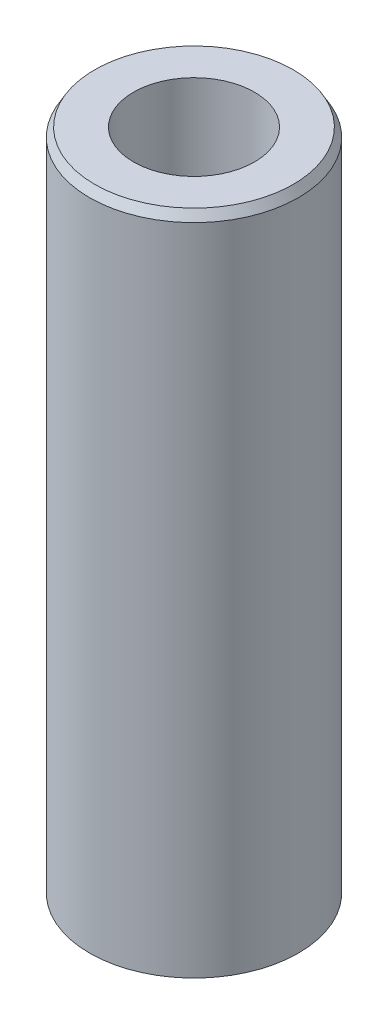
ISO-10303-21;
HEADER;
FILE_DESCRIPTION(('STEP AP214'),'2;1');
FILE_NAME('part.step','',(''),(''),'','','');
FILE_SCHEMA(('AUTOMOTIVE_DESIGN { 1 0 10303 214 1 1 1 1 }'));
ENDSEC;
DATA;
#1=APPLICATION_CONTEXT('core data for automotive mechanical design processes');
#2=APPLICATION_PROTOCOL_DEFINITION('international standard','automotive_design',2000,#1);
#3=PRODUCT_CONTEXT('',#1,'mechanical');
#4=PRODUCT('Part','Part','',(#3));
#5=PRODUCT_RELATED_PRODUCT_CATEGORY('part','',(#4));
#6=PRODUCT_DEFINITION_FORMATION('','',#4);
#7=PRODUCT_DEFINITION_CONTEXT('part definition',#1,'design');
#8=PRODUCT_DEFINITION('design','',#6,#7);
#9=PRODUCT_DEFINITION_SHAPE('','',#8);
#10=(LENGTH_UNIT() NAMED_UNIT(*) SI_UNIT(.MILLI.,.METRE.));
#11=(NAMED_UNIT(*) PLANE_ANGLE_UNIT() SI_UNIT($,.RADIAN.));
#12=(NAMED_UNIT(*) SI_UNIT($,.STERADIAN.) SOLID_ANGLE_UNIT());
#13=UNCERTAINTY_MEASURE_WITH_UNIT(LENGTH_MEASURE(1.E-05),#10,'distance_accuracy_value','');
#14=(GEOMETRIC_REPRESENTATION_CONTEXT(3) GLOBAL_UNCERTAINTY_ASSIGNED_CONTEXT((#13)) GLOBAL_UNIT_ASSIGNED_CONTEXT((#10,
#11,#12)) REPRESENTATION_CONTEXT('',''));
#15=CARTESIAN_POINT('',(0.,0.,0.));
#16=DIRECTION('',(0.,0.,1.));
#17=DIRECTION('',(1.,0.,0.));
#18=AXIS2_PLACEMENT_3D('',#15,#16,#17);
#19=CARTESIAN_POINT('',(0.,127.952762042373,0.));
#20=DIRECTION('',(0.,-1.,0.));
#21=DIRECTION('',(0.,0.,-1.));
#22=AXIS2_PLACEMENT_3D('',#19,#20,#21);
#23=CYLINDRICAL_SURFACE('',#22,20.);
#24=CARTESIAN_POINT('',(0.,126.243420908758,0.));
#25=DIRECTION('',(0.,1.,0.));
#26=DIRECTION('',(0.,0.,1.));
#27=AXIS2_PLACEMENT_3D('',#24,#25,#26);
#28=CIRCLE('',#27,20.);
#29=CARTESIAN_POINT('',(0.,126.243420908758,20.));
#30=VERTEX_POINT('',#29);
#31=EDGE_CURVE('E50',#30,#30,#28,.F.);
#32=ORIENTED_EDGE('',*,*,#31,.T.);
#33=EDGE_LOOP('',(#32));
#34=FACE_BOUND('',#33,.T.);
#35=CARTESIAN_POINT('',(0.,0.986888563629024,0.));
#36=DIRECTION('',(0.,1.,0.));
#37=DIRECTION('',(0.,0.,1.));
#38=AXIS2_PLACEMENT_3D('',#35,#36,#37);
#39=CIRCLE('',#38,20.);
#40=CARTESIAN_POINT('',(0.,0.986888563629024,20.));
#41=VERTEX_POINT('',#40);
#42=EDGE_CURVE('E51',#41,#41,#39,.T.);
#43=ORIENTED_EDGE('',*,*,#42,.T.);
#44=EDGE_LOOP('',(#43));
#45=FACE_BOUND('',#44,.T.);
#46=ADVANCED_FACE('F39',(#34,#45),#23,.T.);
#47=CARTESIAN_POINT('',(0.,127.952762042373,0.));
#48=DIRECTION('',(0.,1.,0.));
#49=DIRECTION('',(0.,0.,1.));
#50=AXIS2_PLACEMENT_3D('',#47,#48,#49);
#51=PLANE('',#50);
#52=CARTESIAN_POINT('',(0.,127.952762042373,0.));
#53=DIRECTION('',(0.,1.,0.));
#54=DIRECTION('',(0.,0.,1.));
#55=AXIS2_PLACEMENT_3D('',#52,#53,#54);
#56=CIRCLE('',#55,19.013111436371);
#57=CARTESIAN_POINT('',(0.,127.952762042373,19.013111436371));
#58=VERTEX_POINT('',#57);
#59=EDGE_CURVE('E54',#58,#58,#56,.T.);
#60=ORIENTED_EDGE('',*,*,#59,.T.);
#61=EDGE_LOOP('',(#60));
#62=FACE_BOUND('',#61,.T.);
#63=CARTESIAN_POINT('',(0.,127.952762042373,0.));
#64=DIRECTION('',(0.,1.,0.));
#65=DIRECTION('',(0.,0.,1.));
#66=AXIS2_PLACEMENT_3D('',#63,#64,#65);
#67=CIRCLE('',#66,11.5851780816609);
#68=CARTESIAN_POINT('',(0.,127.952762042373,11.5851780816609));
#69=VERTEX_POINT('',#68);
#70=EDGE_CURVE('E58',#69,#69,#67,.T.);
#71=ORIENTED_EDGE('',*,*,#70,.F.);
#72=EDGE_LOOP('',(#71));
#73=FACE_BOUND('',#72,.T.);
#74=ADVANCED_FACE('F69',(#62,#73),#51,.T.);
#75=CARTESIAN_POINT('',(0.,0.,0.));
#76=DIRECTION('',(0.,1.,0.));
#77=DIRECTION('',(0.,0.,1.));
#78=AXIS2_PLACEMENT_3D('',#75,#76,#77);
#79=PLANE('',#78);
#80=CARTESIAN_POINT('',(0.,0.,0.));
#81=DIRECTION('',(0.,1.,0.));
#82=DIRECTION('',(0.,0.,1.));
#83=AXIS2_PLACEMENT_3D('',#80,#81,#82);
#84=CIRCLE('',#83,18.2906588663859);
#85=CARTESIAN_POINT('',(0.,0.,18.2906588663859));
#86=VERTEX_POINT('',#85);
#87=EDGE_CURVE('E10',#86,#86,#84,.F.);
#88=ORIENTED_EDGE('',*,*,#87,.T.);
#89=EDGE_LOOP('',(#88));
#90=FACE_BOUND('',#89,.T.);
#91=CARTESIAN_POINT('',(0.,0.,0.));
#92=DIRECTION('',(0.,1.,0.));
#93=DIRECTION('',(0.,0.,1.));
#94=AXIS2_PLACEMENT_3D('',#91,#92,#93);
#95=CIRCLE('',#94,11.5851780816609);
#96=CARTESIAN_POINT('',(0.,0.,11.5851780816609));
#97=VERTEX_POINT('',#96);
#98=EDGE_CURVE('E63',#97,#97,#95,.T.);
#99=ORIENTED_EDGE('',*,*,#98,.T.);
#100=EDGE_LOOP('',(#99));
#101=FACE_BOUND('',#100,.T.);
#102=ADVANCED_FACE('F75',(#90,#101),#79,.F.);
#103=CARTESIAN_POINT('',(0.,127.952762042373,0.));
#104=DIRECTION('',(0.,-1.,0.));
#105=DIRECTION('',(0.,0.,-1.));
#106=AXIS2_PLACEMENT_3D('',#103,#104,#105);
#107=CYLINDRICAL_SURFACE('',#106,11.5851780816609);
#108=ORIENTED_EDGE('',*,*,#70,.T.);
#109=EDGE_LOOP('',(#108));
#110=FACE_BOUND('',#109,.T.);
#111=ORIENTED_EDGE('',*,*,#98,.F.);
#112=EDGE_LOOP('',(#111));
#113=FACE_BOUND('',#112,.T.);
#114=ADVANCED_FACE('F70',(#110,#113),#107,.F.);
#115=CARTESIAN_POINT('',(0.,127.952762042373,0.));
#116=DIRECTION('',(0.,-1.,0.));
#117=DIRECTION('',(0.,0.,-1.));
#118=AXIS2_PLACEMENT_3D('',#115,#116,#117);
#119=CONICAL_SURFACE('',#118,19.013111436371,0.52359877559829);
#120=ORIENTED_EDGE('',*,*,#31,.F.);
#121=EDGE_LOOP('',(#120));
#122=FACE_BOUND('',#121,.T.);
#123=ORIENTED_EDGE('',*,*,#59,.F.);
#124=EDGE_LOOP('',(#123));
#125=FACE_BOUND('',#124,.T.);
#126=ADVANCED_FACE('F81',(#122,#125),#119,.T.);
#127=CARTESIAN_POINT('',(0.,0.986888563629024,0.));
#128=DIRECTION('',(0.,1.,0.));
#129=DIRECTION('',(0.,0.,1.));
#130=AXIS2_PLACEMENT_3D('',#127,#128,#129);
#131=CONICAL_SURFACE('',#130,20.,1.0471975511966);
#132=ORIENTED_EDGE('',*,*,#87,.F.);
#133=EDGE_LOOP('',(#132));
#134=FACE_BOUND('',#133,.T.);
#135=ORIENTED_EDGE('',*,*,#42,.F.);
#136=EDGE_LOOP('',(#135));
#137=FACE_BOUND('',#136,.T.);
#138=ADVANCED_FACE('F45',(#134,#137),#131,.T.);
#139=CLOSED_SHELL('',(#46,#74,#102,#114,#126,#138));
#140=MANIFOLD_SOLID_BREP('B2',#139);
#141=ADVANCED_BREP_SHAPE_REPRESENTATION('',(#18,#140),#14);
#142=SHAPE_DEFINITION_REPRESENTATION(#9,#141);
ENDSEC;
END-ISO-10303-21;
